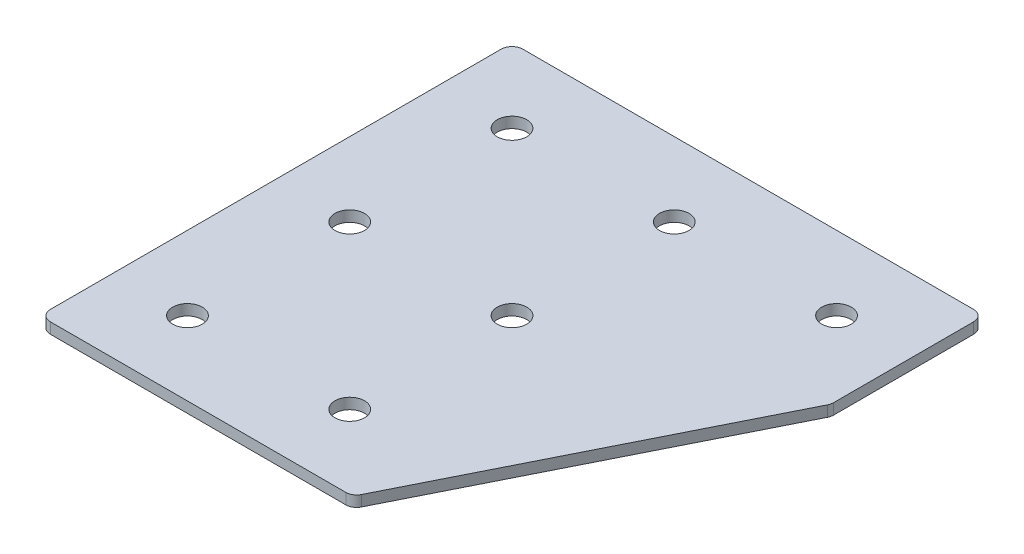
ISO-10303-21;
HEADER;
FILE_DESCRIPTION(('STEP AP214'),'2;1');
FILE_NAME('part.step','',(''),(''),'','','');
FILE_SCHEMA(('AUTOMOTIVE_DESIGN { 1 0 10303 214 1 1 1 1 }'));
ENDSEC;
DATA;
#1=APPLICATION_CONTEXT('core data for automotive mechanical design processes');
#2=APPLICATION_PROTOCOL_DEFINITION('international standard','automotive_design',2000,#1);
#3=PRODUCT_CONTEXT('',#1,'mechanical');
#4=PRODUCT('Part','Part','',(#3));
#5=PRODUCT_RELATED_PRODUCT_CATEGORY('part','',(#4));
#6=PRODUCT_DEFINITION_FORMATION('','',#4);
#7=PRODUCT_DEFINITION_CONTEXT('part definition',#1,'design');
#8=PRODUCT_DEFINITION('design','',#6,#7);
#9=PRODUCT_DEFINITION_SHAPE('','',#8);
#10=(LENGTH_UNIT() NAMED_UNIT(*) SI_UNIT(.MILLI.,.METRE.));
#11=(NAMED_UNIT(*) PLANE_ANGLE_UNIT() SI_UNIT($,.RADIAN.));
#12=(NAMED_UNIT(*) SI_UNIT($,.STERADIAN.) SOLID_ANGLE_UNIT());
#13=UNCERTAINTY_MEASURE_WITH_UNIT(LENGTH_MEASURE(1.E-05),#10,'distance_accuracy_value','');
#14=(GEOMETRIC_REPRESENTATION_CONTEXT(3) GLOBAL_UNCERTAINTY_ASSIGNED_CONTEXT((#13)) GLOBAL_UNIT_ASSIGNED_CONTEXT((#10,
#11,#12)) REPRESENTATION_CONTEXT('',''));
#15=CARTESIAN_POINT('',(0.,0.,0.));
#16=DIRECTION('',(0.,0.,1.));
#17=DIRECTION('',(1.,0.,0.));
#18=AXIS2_PLACEMENT_3D('',#15,#16,#17);
#19=CARTESIAN_POINT('',(-24.6826268608719,2.29118221115959,-46.6079392270853));
#20=DIRECTION('',(0.,-1.,0.));
#21=DIRECTION('',(0.,0.,-1.));
#22=AXIS2_PLACEMENT_3D('',#19,#20,#21);
#23=PLANE('',#22);
#24=CARTESIAN_POINT('',(-2.18262686087191,2.29118221115959,43.3920607729147));
#25=DIRECTION('',(0.,1.,0.));
#26=DIRECTION('',(0.,0.,1.));
#27=AXIS2_PLACEMENT_3D('',#24,#25,#26);
#28=CIRCLE('',#27,4.1);
#29=CARTESIAN_POINT('',(-2.18262686087191,2.29118221115959,47.4920607729147));
#30=VERTEX_POINT('',#29);
#31=EDGE_CURVE('E255',#30,#30,#28,.T.);
#32=ORIENTED_EDGE('',*,*,#31,.T.);
#33=EDGE_LOOP('',(#32));
#34=FACE_BOUND('',#33,.T.);
#35=CARTESIAN_POINT('',(-47.1826268608719,2.29118221115959,43.3920607729147));
#36=DIRECTION('',(0.,1.,0.));
#37=DIRECTION('',(0.,0.,1.));
#38=AXIS2_PLACEMENT_3D('',#35,#36,#37);
#39=CIRCLE('',#38,4.1);
#40=CARTESIAN_POINT('',(-47.1826268608719,2.29118221115959,47.4920607729147));
#41=VERTEX_POINT('',#40);
#42=EDGE_CURVE('E263',#41,#41,#39,.T.);
#43=ORIENTED_EDGE('',*,*,#42,.T.);
#44=EDGE_LOOP('',(#43));
#45=FACE_BOUND('',#44,.T.);
#46=CARTESIAN_POINT('',(-2.18262686087191,2.29118221115959,-1.60793922708531));
#47=DIRECTION('',(0.,1.,0.));
#48=DIRECTION('',(0.,0.,1.));
#49=AXIS2_PLACEMENT_3D('',#46,#47,#48);
#50=CIRCLE('',#49,4.1);
#51=CARTESIAN_POINT('',(-2.18262686087191,2.29118221115959,2.49206077291469));
#52=VERTEX_POINT('',#51);
#53=EDGE_CURVE('E269',#52,#52,#50,.T.);
#54=ORIENTED_EDGE('',*,*,#53,.T.);
#55=EDGE_LOOP('',(#54));
#56=FACE_BOUND('',#55,.T.);
#57=CARTESIAN_POINT('',(-47.1826268608719,2.29118221115959,-1.60793922708531));
#58=DIRECTION('',(0.,1.,0.));
#59=DIRECTION('',(0.,0.,1.));
#60=AXIS2_PLACEMENT_3D('',#57,#58,#59);
#61=CIRCLE('',#60,4.1);
#62=CARTESIAN_POINT('',(-47.1826268608719,2.29118221115959,2.49206077291469));
#63=VERTEX_POINT('',#62);
#64=EDGE_CURVE('E275',#63,#63,#61,.T.);
#65=ORIENTED_EDGE('',*,*,#64,.T.);
#66=EDGE_LOOP('',(#65));
#67=FACE_BOUND('',#66,.T.);
#68=CARTESIAN_POINT('',(42.8173731391281,2.29118221115959,-46.6079392270853));
#69=DIRECTION('',(0.,1.,0.));
#70=DIRECTION('',(0.,0.,1.));
#71=AXIS2_PLACEMENT_3D('',#68,#69,#70);
#72=CIRCLE('',#71,4.09999999999999);
#73=CARTESIAN_POINT('',(42.8173731391281,2.29118221115959,-42.5079392270853));
#74=VERTEX_POINT('',#73);
#75=EDGE_CURVE('E281',#74,#74,#72,.T.);
#76=ORIENTED_EDGE('',*,*,#75,.T.);
#77=EDGE_LOOP('',(#76));
#78=FACE_BOUND('',#77,.T.);
#79=CARTESIAN_POINT('',(-2.1826268608719,2.29118221115959,-46.6079392270853));
#80=DIRECTION('',(0.,1.,0.));
#81=DIRECTION('',(0.,0.,1.));
#82=AXIS2_PLACEMENT_3D('',#79,#80,#81);
#83=CIRCLE('',#82,4.1);
#84=CARTESIAN_POINT('',(-2.1826268608719,2.29118221115959,-42.5079392270853));
#85=VERTEX_POINT('',#84);
#86=EDGE_CURVE('E287',#85,#85,#83,.T.);
#87=ORIENTED_EDGE('',*,*,#86,.T.);
#88=EDGE_LOOP('',(#87));
#89=FACE_BOUND('',#88,.T.);
#90=CARTESIAN_POINT('',(-47.1826268608719,2.29118221115959,-46.6079392270853));
#91=DIRECTION('',(0.,1.,0.));
#92=DIRECTION('',(0.,0.,1.));
#93=AXIS2_PLACEMENT_3D('',#90,#91,#92);
#94=CIRCLE('',#93,4.1);
#95=CARTESIAN_POINT('',(-47.1826268608719,2.29118221115959,-42.5079392270853));
#96=VERTEX_POINT('',#95);
#97=EDGE_CURVE('E175',#96,#96,#94,.T.);
#98=ORIENTED_EDGE('',*,*,#97,.T.);
#99=EDGE_LOOP('',(#98));
#100=FACE_BOUND('',#99,.T.);
#101=DIRECTION('',(1.,0.,0.));
#102=VECTOR('',#101,1.);
#103=CARTESIAN_POINT('',(-67.682626860872,2.29118221115959,63.8920607729147));
#104=LINE('',#103,#102);
#105=CARTESIAN_POINT('',(-64.682626860872,2.29118221115959,63.8920607729147));
#106=VERTEX_POINT('',#105);
#107=CARTESIAN_POINT('',(17.2272031953787,2.29118221115959,63.8920607729147));
#108=VERTEX_POINT('',#107);
#109=EDGE_CURVE('E121',#106,#108,#104,.T.);
#110=ORIENTED_EDGE('',*,*,#109,.F.);
#111=CARTESIAN_POINT('',(-64.682626860872,2.29118221115959,60.8920607729147));
#112=DIRECTION('',(0.,-1.,0.));
#113=DIRECTION('',(0.,0.,-1.));
#114=AXIS2_PLACEMENT_3D('',#111,#112,#113);
#115=CIRCLE('',#114,3.);
#116=CARTESIAN_POINT('',(-67.682626860872,2.29118221115959,60.8920607729147));
#117=VERTEX_POINT('',#116);
#118=EDGE_CURVE('E145',#106,#117,#115,.T.);
#119=ORIENTED_EDGE('',*,*,#118,.T.);
#120=DIRECTION('',(0.,0.,1.));
#121=VECTOR('',#120,1.);
#122=CARTESIAN_POINT('',(-67.682626860872,2.29118221115959,-67.1079392270853));
#123=LINE('',#122,#121);
#124=CARTESIAN_POINT('',(-67.682626860872,2.29118221115959,-64.1079392270853));
#125=VERTEX_POINT('',#124);
#126=EDGE_CURVE('E162',#125,#117,#123,.T.);
#127=ORIENTED_EDGE('',*,*,#126,.F.);
#128=CARTESIAN_POINT('',(-64.682626860872,2.29118221115959,-64.1079392270853));
#129=DIRECTION('',(0.,-1.,0.));
#130=DIRECTION('',(0.,0.,-1.));
#131=AXIS2_PLACEMENT_3D('',#128,#129,#130);
#132=CIRCLE('',#131,3.);
#133=CARTESIAN_POINT('',(-64.682626860872,2.29118221115959,-67.1079392270853));
#134=VERTEX_POINT('',#133);
#135=EDGE_CURVE('E117',#125,#134,#132,.T.);
#136=ORIENTED_EDGE('',*,*,#135,.T.);
#137=DIRECTION('',(-1.,0.,0.));
#138=VECTOR('',#137,1.);
#139=CARTESIAN_POINT('',(63.317373139128,2.29118221115959,-67.1079392270854));
#140=LINE('',#139,#138);
#141=CARTESIAN_POINT('',(60.317373139128,2.29118221115959,-67.1079392270854));
#142=VERTEX_POINT('',#141);
#143=EDGE_CURVE('E160',#142,#134,#140,.T.);
#144=ORIENTED_EDGE('',*,*,#143,.F.);
#145=CARTESIAN_POINT('',(60.317373139128,2.29118221115959,-64.1079392270854));
#146=DIRECTION('',(0.,-1.,0.));
#147=DIRECTION('',(0.,0.,-1.));
#148=AXIS2_PLACEMENT_3D('',#145,#146,#147);
#149=CIRCLE('',#148,3.);
#150=CARTESIAN_POINT('',(63.317373139128,2.29118221115959,-64.1079392270854));
#151=VERTEX_POINT('',#150);
#152=EDGE_CURVE('E140',#142,#151,#149,.T.);
#153=ORIENTED_EDGE('',*,*,#152,.T.);
#154=DIRECTION('',(0.,0.,-1.));
#155=VECTOR('',#154,1.);
#156=CARTESIAN_POINT('',(63.317373139128,2.29118221115959,-24.5800751820849));
#157=LINE('',#156,#155);
#158=CARTESIAN_POINT('',(63.317373139128,2.29118221115959,-25.2882791145842));
#159=VERTEX_POINT('',#158);
#160=EDGE_CURVE('E163',#159,#151,#157,.T.);
#161=ORIENTED_EDGE('',*,*,#160,.F.);
#162=CARTESIAN_POINT('',(60.317373139128,2.29118221115959,-25.2882791145842));
#163=DIRECTION('',(0.,-1.,0.));
#164=DIRECTION('',(0.,0.,-1.));
#165=AXIS2_PLACEMENT_3D('',#162,#163,#164);
#166=CIRCLE('',#165,3.);
#167=CARTESIAN_POINT('',(63.0006547121278,2.29118221115959,-23.9466383280844));
#168=VERTEX_POINT('',#167);
#169=EDGE_CURVE('E31',#159,#168,#166,.T.);
#170=ORIENTED_EDGE('',*,*,#169,.T.);
#171=DIRECTION('',(0.447213595499957,0.,-0.894427190999917));
#172=VECTOR('',#171,1.);
#173=CARTESIAN_POINT('',(19.0813051616284,2.29118221115959,63.8920607729147));
#174=LINE('',#173,#172);
#175=CARTESIAN_POINT('',(19.9104847683784,2.29118221115959,62.2337015594145));
#176=VERTEX_POINT('',#175);
#177=EDGE_CURVE('E118',#176,#168,#174,.T.);
#178=ORIENTED_EDGE('',*,*,#177,.F.);
#179=CARTESIAN_POINT('',(17.2272031953787,2.29118221115959,60.8920607729147));
#180=DIRECTION('',(0.,-1.,0.));
#181=DIRECTION('',(0.,0.,-1.));
#182=AXIS2_PLACEMENT_3D('',#179,#180,#181);
#183=CIRCLE('',#182,3.);
#184=EDGE_CURVE('E143',#176,#108,#183,.T.);
#185=ORIENTED_EDGE('',*,*,#184,.T.);
#186=EDGE_LOOP('',(#110,#119,#127,#136,#144,#153,#161,#170,#178,#185));
#187=FACE_BOUND('',#186,.T.);
#188=ADVANCED_FACE('F16',(#34,#45,#56,#67,#78,#89,#100,#187),#23,.T.);
#189=CARTESIAN_POINT('',(63.317373139128,2.29118221115959,-24.5800751820849));
#190=DIRECTION('',(1.,0.,0.));
#191=DIRECTION('',(0.,0.,-1.));
#192=AXIS2_PLACEMENT_3D('',#189,#190,#191);
#193=PLANE('',#192);
#194=DIRECTION('',(0.,0.,-1.));
#195=VECTOR('',#194,1.);
#196=CARTESIAN_POINT('',(63.317373139128,5.29118221115959,-24.5800751820849));
#197=LINE('',#196,#195);
#198=CARTESIAN_POINT('',(63.317373139128,5.29118221115959,-25.2882791145842));
#199=VERTEX_POINT('',#198);
#200=CARTESIAN_POINT('',(63.317373139128,5.29118221115959,-64.1079392270854));
#201=VERTEX_POINT('',#200);
#202=EDGE_CURVE('E172',#199,#201,#197,.T.);
#203=ORIENTED_EDGE('',*,*,#202,.F.);
#204=DIRECTION('',(0.,1.,0.));
#205=VECTOR('',#204,1.);
#206=CARTESIAN_POINT('',(63.317373139128,2.29118221115959,-25.2882791145842));
#207=LINE('',#206,#205);
#208=EDGE_CURVE('E154',#199,#159,#207,.F.);
#209=ORIENTED_EDGE('',*,*,#208,.T.);
#210=ORIENTED_EDGE('',*,*,#160,.T.);
#211=DIRECTION('',(0.,1.,0.));
#212=VECTOR('',#211,1.);
#213=CARTESIAN_POINT('',(63.317373139128,2.29118221115959,-64.1079392270854));
#214=LINE('',#213,#212);
#215=EDGE_CURVE('E151',#151,#201,#214,.T.);
#216=ORIENTED_EDGE('',*,*,#215,.T.);
#217=EDGE_LOOP('',(#203,#209,#210,#216));
#218=FACE_BOUND('',#217,.T.);
#219=ADVANCED_FACE('F206',(#218),#193,.T.);
#220=CARTESIAN_POINT('',(19.0813051616284,2.29118221115959,63.8920607729147));
#221=DIRECTION('',(0.894427190999917,0.,0.447213595499957));
#222=DIRECTION('',(0.447213595499957,0.,-0.894427190999917));
#223=AXIS2_PLACEMENT_3D('',#220,#221,#222);
#224=PLANE('',#223);
#225=DIRECTION('',(0.447213595499957,0.,-0.894427190999917));
#226=VECTOR('',#225,1.);
#227=CARTESIAN_POINT('',(19.0813051616284,5.29118221115959,63.8920607729147));
#228=LINE('',#227,#226);
#229=CARTESIAN_POINT('',(19.9104847683784,5.29118221115959,62.2337015594145));
#230=VERTEX_POINT('',#229);
#231=CARTESIAN_POINT('',(63.0006547121278,5.29118221115959,-23.9466383280844));
#232=VERTEX_POINT('',#231);
#233=EDGE_CURVE('E124',#230,#232,#228,.T.);
#234=ORIENTED_EDGE('',*,*,#233,.F.);
#235=DIRECTION('',(0.,1.,0.));
#236=VECTOR('',#235,1.);
#237=CARTESIAN_POINT('',(19.9104847683784,2.29118221115959,62.2337015594145));
#238=LINE('',#237,#236);
#239=EDGE_CURVE('E38',#230,#176,#238,.F.);
#240=ORIENTED_EDGE('',*,*,#239,.T.);
#241=ORIENTED_EDGE('',*,*,#177,.T.);
#242=DIRECTION('',(0.,1.,0.));
#243=VECTOR('',#242,1.);
#244=CARTESIAN_POINT('',(63.0006547121277,2.29118221115959,-23.9466383280844));
#245=LINE('',#244,#243);
#246=EDGE_CURVE('E147',#168,#232,#245,.T.);
#247=ORIENTED_EDGE('',*,*,#246,.T.);
#248=EDGE_LOOP('',(#234,#240,#241,#247));
#249=FACE_BOUND('',#248,.T.);
#250=ADVANCED_FACE('F180',(#249),#224,.T.);
#251=CARTESIAN_POINT('',(-67.682626860872,2.29118221115959,63.8920607729147));
#252=DIRECTION('',(0.,0.,1.));
#253=DIRECTION('',(1.,0.,0.));
#254=AXIS2_PLACEMENT_3D('',#251,#252,#253);
#255=PLANE('',#254);
#256=DIRECTION('',(1.,0.,0.));
#257=VECTOR('',#256,1.);
#258=CARTESIAN_POINT('',(-67.682626860872,5.29118221115959,63.8920607729147));
#259=LINE('',#258,#257);
#260=CARTESIAN_POINT('',(-64.682626860872,5.29118221115959,63.8920607729147));
#261=VERTEX_POINT('',#260);
#262=CARTESIAN_POINT('',(17.2272031953787,5.29118221115959,63.8920607729147));
#263=VERTEX_POINT('',#262);
#264=EDGE_CURVE('E114',#261,#263,#259,.T.);
#265=ORIENTED_EDGE('',*,*,#264,.F.);
#266=DIRECTION('',(0.,1.,0.));
#267=VECTOR('',#266,1.);
#268=CARTESIAN_POINT('',(-64.682626860872,2.29118221115959,63.8920607729147));
#269=LINE('',#268,#267);
#270=EDGE_CURVE('E137',#261,#106,#269,.F.);
#271=ORIENTED_EDGE('',*,*,#270,.T.);
#272=ORIENTED_EDGE('',*,*,#109,.T.);
#273=DIRECTION('',(0.,1.,0.));
#274=VECTOR('',#273,1.);
#275=CARTESIAN_POINT('',(17.2272031953787,2.29118221115959,63.8920607729147));
#276=LINE('',#275,#274);
#277=EDGE_CURVE('E134',#108,#263,#276,.T.);
#278=ORIENTED_EDGE('',*,*,#277,.T.);
#279=EDGE_LOOP('',(#265,#271,#272,#278));
#280=FACE_BOUND('',#279,.T.);
#281=ADVANCED_FACE('F189',(#280),#255,.T.);
#282=CARTESIAN_POINT('',(-67.682626860872,2.29118221115959,-67.1079392270853));
#283=DIRECTION('',(-1.,0.,0.));
#284=DIRECTION('',(0.,0.,1.));
#285=AXIS2_PLACEMENT_3D('',#282,#283,#284);
#286=PLANE('',#285);
#287=ORIENTED_EDGE('',*,*,#126,.T.);
#288=DIRECTION('',(0.,1.,0.));
#289=VECTOR('',#288,1.);
#290=CARTESIAN_POINT('',(-67.682626860872,2.29118221115959,60.8920607729147));
#291=LINE('',#290,#289);
#292=CARTESIAN_POINT('',(-67.682626860872,5.29118221115959,60.8920607729147));
#293=VERTEX_POINT('',#292);
#294=EDGE_CURVE('E105',#117,#293,#291,.T.);
#295=ORIENTED_EDGE('',*,*,#294,.T.);
#296=DIRECTION('',(0.,0.,1.));
#297=VECTOR('',#296,1.);
#298=CARTESIAN_POINT('',(-67.682626860872,5.29118221115959,-67.1079392270853));
#299=LINE('',#298,#297);
#300=CARTESIAN_POINT('',(-67.682626860872,5.29118221115959,-64.1079392270853));
#301=VERTEX_POINT('',#300);
#302=EDGE_CURVE('E97',#301,#293,#299,.T.);
#303=ORIENTED_EDGE('',*,*,#302,.F.);
#304=DIRECTION('',(0.,1.,0.));
#305=VECTOR('',#304,1.);
#306=CARTESIAN_POINT('',(-67.682626860872,2.29118221115959,-64.1079392270853));
#307=LINE('',#306,#305);
#308=EDGE_CURVE('E111',#301,#125,#307,.F.);
#309=ORIENTED_EDGE('',*,*,#308,.T.);
#310=EDGE_LOOP('',(#287,#295,#303,#309));
#311=FACE_BOUND('',#310,.T.);
#312=ADVANCED_FACE('F110',(#311),#286,.T.);
#313=CARTESIAN_POINT('',(63.317373139128,2.29118221115959,-67.1079392270854));
#314=DIRECTION('',(0.,0.,-1.));
#315=DIRECTION('',(-1.,0.,0.));
#316=AXIS2_PLACEMENT_3D('',#313,#314,#315);
#317=PLANE('',#316);
#318=DIRECTION('',(-1.,0.,0.));
#319=VECTOR('',#318,1.);
#320=CARTESIAN_POINT('',(63.317373139128,5.29118221115959,-67.1079392270854));
#321=LINE('',#320,#319);
#322=CARTESIAN_POINT('',(60.317373139128,5.29118221115959,-67.1079392270854));
#323=VERTEX_POINT('',#322);
#324=CARTESIAN_POINT('',(-64.682626860872,5.29118221115959,-67.1079392270853));
#325=VERTEX_POINT('',#324);
#326=EDGE_CURVE('E99',#323,#325,#321,.T.);
#327=ORIENTED_EDGE('',*,*,#326,.F.);
#328=DIRECTION('',(0.,1.,0.));
#329=VECTOR('',#328,1.);
#330=CARTESIAN_POINT('',(60.317373139128,2.29118221115959,-67.1079392270854));
#331=LINE('',#330,#329);
#332=EDGE_CURVE('E10',#323,#142,#331,.F.);
#333=ORIENTED_EDGE('',*,*,#332,.T.);
#334=ORIENTED_EDGE('',*,*,#143,.T.);
#335=DIRECTION('',(0.,1.,0.));
#336=VECTOR('',#335,1.);
#337=CARTESIAN_POINT('',(-64.682626860872,2.29118221115959,-67.1079392270853));
#338=LINE('',#337,#336);
#339=EDGE_CURVE('E24',#134,#325,#338,.T.);
#340=ORIENTED_EDGE('',*,*,#339,.T.);
#341=EDGE_LOOP('',(#327,#333,#334,#340));
#342=FACE_BOUND('',#341,.T.);
#343=ADVANCED_FACE('F157',(#342),#317,.T.);
#344=CARTESIAN_POINT('',(-24.6826268608719,5.29118221115959,-46.6079392270853));
#345=DIRECTION('',(0.,-1.,0.));
#346=DIRECTION('',(0.,0.,-1.));
#347=AXIS2_PLACEMENT_3D('',#344,#345,#346);
#348=PLANE('',#347);
#349=CARTESIAN_POINT('',(-2.18262686087191,5.29118221115959,43.3920607729147));
#350=DIRECTION('',(0.,1.,0.));
#351=DIRECTION('',(0.,0.,1.));
#352=AXIS2_PLACEMENT_3D('',#349,#350,#351);
#353=CIRCLE('',#352,4.1);
#354=CARTESIAN_POINT('',(-2.18262686087191,5.29118221115959,47.4920607729147));
#355=VERTEX_POINT('',#354);
#356=EDGE_CURVE('E258',#355,#355,#353,.T.);
#357=ORIENTED_EDGE('',*,*,#356,.F.);
#358=EDGE_LOOP('',(#357));
#359=FACE_BOUND('',#358,.T.);
#360=CARTESIAN_POINT('',(-47.1826268608719,5.29118221115959,43.3920607729147));
#361=DIRECTION('',(0.,1.,0.));
#362=DIRECTION('',(0.,0.,1.));
#363=AXIS2_PLACEMENT_3D('',#360,#361,#362);
#364=CIRCLE('',#363,4.1);
#365=CARTESIAN_POINT('',(-47.1826268608719,5.29118221115959,47.4920607729147));
#366=VERTEX_POINT('',#365);
#367=EDGE_CURVE('E260',#366,#366,#364,.T.);
#368=ORIENTED_EDGE('',*,*,#367,.F.);
#369=EDGE_LOOP('',(#368));
#370=FACE_BOUND('',#369,.T.);
#371=CARTESIAN_POINT('',(-2.18262686087191,5.29118221115959,-1.60793922708531));
#372=DIRECTION('',(0.,1.,0.));
#373=DIRECTION('',(0.,0.,1.));
#374=AXIS2_PLACEMENT_3D('',#371,#372,#373);
#375=CIRCLE('',#374,4.1);
#376=CARTESIAN_POINT('',(-2.18262686087191,5.29118221115959,2.49206077291469));
#377=VERTEX_POINT('',#376);
#378=EDGE_CURVE('E266',#377,#377,#375,.T.);
#379=ORIENTED_EDGE('',*,*,#378,.F.);
#380=EDGE_LOOP('',(#379));
#381=FACE_BOUND('',#380,.T.);
#382=CARTESIAN_POINT('',(-47.1826268608719,5.29118221115959,-1.60793922708531));
#383=DIRECTION('',(0.,1.,0.));
#384=DIRECTION('',(0.,0.,1.));
#385=AXIS2_PLACEMENT_3D('',#382,#383,#384);
#386=CIRCLE('',#385,4.1);
#387=CARTESIAN_POINT('',(-47.1826268608719,5.29118221115959,2.49206077291469));
#388=VERTEX_POINT('',#387);
#389=EDGE_CURVE('E272',#388,#388,#386,.T.);
#390=ORIENTED_EDGE('',*,*,#389,.F.);
#391=EDGE_LOOP('',(#390));
#392=FACE_BOUND('',#391,.T.);
#393=CARTESIAN_POINT('',(42.8173731391281,5.29118221115959,-46.6079392270853));
#394=DIRECTION('',(0.,1.,0.));
#395=DIRECTION('',(0.,0.,1.));
#396=AXIS2_PLACEMENT_3D('',#393,#394,#395);
#397=CIRCLE('',#396,4.09999999999999);
#398=CARTESIAN_POINT('',(42.8173731391281,5.29118221115959,-42.5079392270853));
#399=VERTEX_POINT('',#398);
#400=EDGE_CURVE('E278',#399,#399,#397,.T.);
#401=ORIENTED_EDGE('',*,*,#400,.F.);
#402=EDGE_LOOP('',(#401));
#403=FACE_BOUND('',#402,.T.);
#404=CARTESIAN_POINT('',(-2.1826268608719,5.29118221115959,-46.6079392270853));
#405=DIRECTION('',(0.,1.,0.));
#406=DIRECTION('',(0.,0.,1.));
#407=AXIS2_PLACEMENT_3D('',#404,#405,#406);
#408=CIRCLE('',#407,4.1);
#409=CARTESIAN_POINT('',(-2.1826268608719,5.29118221115959,-42.5079392270853));
#410=VERTEX_POINT('',#409);
#411=EDGE_CURVE('E284',#410,#410,#408,.T.);
#412=ORIENTED_EDGE('',*,*,#411,.F.);
#413=EDGE_LOOP('',(#412));
#414=FACE_BOUND('',#413,.T.);
#415=CARTESIAN_POINT('',(-47.1826268608719,5.29118221115959,-46.6079392270853));
#416=DIRECTION('',(0.,1.,0.));
#417=DIRECTION('',(0.,0.,1.));
#418=AXIS2_PLACEMENT_3D('',#415,#416,#417);
#419=CIRCLE('',#418,4.1);
#420=CARTESIAN_POINT('',(-47.1826268608719,5.29118221115959,-42.5079392270853));
#421=VERTEX_POINT('',#420);
#422=EDGE_CURVE('E290',#421,#421,#419,.T.);
#423=ORIENTED_EDGE('',*,*,#422,.F.);
#424=EDGE_LOOP('',(#423));
#425=FACE_BOUND('',#424,.T.);
#426=ORIENTED_EDGE('',*,*,#302,.T.);
#427=CARTESIAN_POINT('',(-64.682626860872,5.29118221115959,60.8920607729147));
#428=DIRECTION('',(0.,-1.,0.));
#429=DIRECTION('',(0.,0.,-1.));
#430=AXIS2_PLACEMENT_3D('',#427,#428,#429);
#431=CIRCLE('',#430,3.);
#432=EDGE_CURVE('E132',#293,#261,#431,.F.);
#433=ORIENTED_EDGE('',*,*,#432,.T.);
#434=ORIENTED_EDGE('',*,*,#264,.T.);
#435=CARTESIAN_POINT('',(17.2272031953787,5.29118221115959,60.8920607729147));
#436=DIRECTION('',(0.,-1.,0.));
#437=DIRECTION('',(0.,0.,-1.));
#438=AXIS2_PLACEMENT_3D('',#435,#436,#437);
#439=CIRCLE('',#438,3.);
#440=EDGE_CURVE('E130',#263,#230,#439,.F.);
#441=ORIENTED_EDGE('',*,*,#440,.T.);
#442=ORIENTED_EDGE('',*,*,#233,.T.);
#443=CARTESIAN_POINT('',(60.317373139128,5.29118221115959,-25.2882791145842));
#444=DIRECTION('',(0.,-1.,0.));
#445=DIRECTION('',(0.,0.,-1.));
#446=AXIS2_PLACEMENT_3D('',#443,#444,#445);
#447=CIRCLE('',#446,3.);
#448=EDGE_CURVE('E128',#232,#199,#447,.F.);
#449=ORIENTED_EDGE('',*,*,#448,.T.);
#450=ORIENTED_EDGE('',*,*,#202,.T.);
#451=CARTESIAN_POINT('',(60.317373139128,5.29118221115959,-64.1079392270854));
#452=DIRECTION('',(0.,-1.,0.));
#453=DIRECTION('',(0.,0.,-1.));
#454=AXIS2_PLACEMENT_3D('',#451,#452,#453);
#455=CIRCLE('',#454,3.);
#456=EDGE_CURVE('E104',#201,#323,#455,.F.);
#457=ORIENTED_EDGE('',*,*,#456,.T.);
#458=ORIENTED_EDGE('',*,*,#326,.T.);
#459=CARTESIAN_POINT('',(-64.682626860872,5.29118221115959,-64.1079392270853));
#460=DIRECTION('',(0.,-1.,0.));
#461=DIRECTION('',(0.,0.,-1.));
#462=AXIS2_PLACEMENT_3D('',#459,#460,#461);
#463=CIRCLE('',#462,3.);
#464=EDGE_CURVE('E94',#325,#301,#463,.F.);
#465=ORIENTED_EDGE('',*,*,#464,.T.);
#466=EDGE_LOOP('',(#426,#433,#434,#441,#442,#449,#450,#457,#458,#465));
#467=FACE_BOUND('',#466,.T.);
#468=ADVANCED_FACE('F96',(#359,#370,#381,#392,#403,#414,#425,#467),#348,.F.);
#469=CARTESIAN_POINT('',(-64.682626860872,2.29118221115959,60.8920607729147));
#470=DIRECTION('',(0.,1.,0.));
#471=DIRECTION('',(0.,0.,1.));
#472=AXIS2_PLACEMENT_3D('',#469,#470,#471);
#473=CYLINDRICAL_SURFACE('',#472,3.);
#474=ORIENTED_EDGE('',*,*,#118,.F.);
#475=ORIENTED_EDGE('',*,*,#270,.F.);
#476=ORIENTED_EDGE('',*,*,#432,.F.);
#477=ORIENTED_EDGE('',*,*,#294,.F.);
#478=EDGE_LOOP('',(#474,#475,#476,#477));
#479=FACE_BOUND('',#478,.T.);
#480=ADVANCED_FACE('F192',(#479),#473,.T.);
#481=CARTESIAN_POINT('',(17.2272031953787,2.29118221115959,60.8920607729147));
#482=DIRECTION('',(0.,1.,0.));
#483=DIRECTION('',(0.,0.,1.));
#484=AXIS2_PLACEMENT_3D('',#481,#482,#483);
#485=CYLINDRICAL_SURFACE('',#484,3.);
#486=ORIENTED_EDGE('',*,*,#184,.F.);
#487=ORIENTED_EDGE('',*,*,#239,.F.);
#488=ORIENTED_EDGE('',*,*,#440,.F.);
#489=ORIENTED_EDGE('',*,*,#277,.F.);
#490=EDGE_LOOP('',(#486,#487,#488,#489));
#491=FACE_BOUND('',#490,.T.);
#492=ADVANCED_FACE('F184',(#491),#485,.T.);
#493=CARTESIAN_POINT('',(60.317373139128,2.29118221115959,-25.2882791145842));
#494=DIRECTION('',(0.,1.,0.));
#495=DIRECTION('',(0.,0.,1.));
#496=AXIS2_PLACEMENT_3D('',#493,#494,#495);
#497=CYLINDRICAL_SURFACE('',#496,3.);
#498=ORIENTED_EDGE('',*,*,#169,.F.);
#499=ORIENTED_EDGE('',*,*,#208,.F.);
#500=ORIENTED_EDGE('',*,*,#448,.F.);
#501=ORIENTED_EDGE('',*,*,#246,.F.);
#502=EDGE_LOOP('',(#498,#499,#500,#501));
#503=FACE_BOUND('',#502,.T.);
#504=ADVANCED_FACE('F200',(#503),#497,.T.);
#505=CARTESIAN_POINT('',(60.317373139128,2.29118221115959,-64.1079392270854));
#506=DIRECTION('',(0.,1.,0.));
#507=DIRECTION('',(0.,0.,1.));
#508=AXIS2_PLACEMENT_3D('',#505,#506,#507);
#509=CYLINDRICAL_SURFACE('',#508,3.);
#510=ORIENTED_EDGE('',*,*,#152,.F.);
#511=ORIENTED_EDGE('',*,*,#332,.F.);
#512=ORIENTED_EDGE('',*,*,#456,.F.);
#513=ORIENTED_EDGE('',*,*,#215,.F.);
#514=EDGE_LOOP('',(#510,#511,#512,#513));
#515=FACE_BOUND('',#514,.T.);
#516=ADVANCED_FACE('F356',(#515),#509,.T.);
#517=CARTESIAN_POINT('',(-64.682626860872,2.29118221115959,-64.1079392270853));
#518=DIRECTION('',(0.,1.,0.));
#519=DIRECTION('',(0.,0.,1.));
#520=AXIS2_PLACEMENT_3D('',#517,#518,#519);
#521=CYLINDRICAL_SURFACE('',#520,3.);
#522=ORIENTED_EDGE('',*,*,#135,.F.);
#523=ORIENTED_EDGE('',*,*,#308,.F.);
#524=ORIENTED_EDGE('',*,*,#464,.F.);
#525=ORIENTED_EDGE('',*,*,#339,.F.);
#526=EDGE_LOOP('',(#522,#523,#524,#525));
#527=FACE_BOUND('',#526,.T.);
#528=ADVANCED_FACE('F18',(#527),#521,.T.);
#529=CARTESIAN_POINT('',(-47.1826268608719,2.29118221115959,-46.6079392270853));
#530=DIRECTION('',(0.,1.,0.));
#531=DIRECTION('',(0.,0.,1.));
#532=AXIS2_PLACEMENT_3D('',#529,#530,#531);
#533=CYLINDRICAL_SURFACE('',#532,4.1);
#534=ORIENTED_EDGE('',*,*,#97,.F.);
#535=EDGE_LOOP('',(#534));
#536=FACE_BOUND('',#535,.T.);
#537=ORIENTED_EDGE('',*,*,#422,.T.);
#538=EDGE_LOOP('',(#537));
#539=FACE_BOUND('',#538,.T.);
#540=ADVANCED_FACE('F224',(#536,#539),#533,.F.);
#541=CARTESIAN_POINT('',(-2.1826268608719,2.29118221115959,-46.6079392270853));
#542=DIRECTION('',(0.,1.,0.));
#543=DIRECTION('',(0.,0.,1.));
#544=AXIS2_PLACEMENT_3D('',#541,#542,#543);
#545=CYLINDRICAL_SURFACE('',#544,4.1);
#546=ORIENTED_EDGE('',*,*,#86,.F.);
#547=EDGE_LOOP('',(#546));
#548=FACE_BOUND('',#547,.T.);
#549=ORIENTED_EDGE('',*,*,#411,.T.);
#550=EDGE_LOOP('',(#549));
#551=FACE_BOUND('',#550,.T.);
#552=ADVANCED_FACE('F227',(#548,#551),#545,.F.);
#553=CARTESIAN_POINT('',(42.8173731391281,2.29118221115959,-46.6079392270853));
#554=DIRECTION('',(0.,1.,0.));
#555=DIRECTION('',(0.,0.,1.));
#556=AXIS2_PLACEMENT_3D('',#553,#554,#555);
#557=CYLINDRICAL_SURFACE('',#556,4.09999999999999);
#558=ORIENTED_EDGE('',*,*,#75,.F.);
#559=EDGE_LOOP('',(#558));
#560=FACE_BOUND('',#559,.T.);
#561=ORIENTED_EDGE('',*,*,#400,.T.);
#562=EDGE_LOOP('',(#561));
#563=FACE_BOUND('',#562,.T.);
#564=ADVANCED_FACE('F231',(#560,#563),#557,.F.);
#565=CARTESIAN_POINT('',(-47.1826268608719,2.29118221115959,-1.60793922708531));
#566=DIRECTION('',(0.,1.,0.));
#567=DIRECTION('',(0.,0.,1.));
#568=AXIS2_PLACEMENT_3D('',#565,#566,#567);
#569=CYLINDRICAL_SURFACE('',#568,4.1);
#570=ORIENTED_EDGE('',*,*,#64,.F.);
#571=EDGE_LOOP('',(#570));
#572=FACE_BOUND('',#571,.T.);
#573=ORIENTED_EDGE('',*,*,#389,.T.);
#574=EDGE_LOOP('',(#573));
#575=FACE_BOUND('',#574,.T.);
#576=ADVANCED_FACE('F235',(#572,#575),#569,.F.);
#577=CARTESIAN_POINT('',(-2.18262686087191,2.29118221115959,-1.60793922708531));
#578=DIRECTION('',(0.,1.,0.));
#579=DIRECTION('',(0.,0.,1.));
#580=AXIS2_PLACEMENT_3D('',#577,#578,#579);
#581=CYLINDRICAL_SURFACE('',#580,4.1);
#582=ORIENTED_EDGE('',*,*,#53,.F.);
#583=EDGE_LOOP('',(#582));
#584=FACE_BOUND('',#583,.T.);
#585=ORIENTED_EDGE('',*,*,#378,.T.);
#586=EDGE_LOOP('',(#585));
#587=FACE_BOUND('',#586,.T.);
#588=ADVANCED_FACE('F239',(#584,#587),#581,.F.);
#589=CARTESIAN_POINT('',(-47.1826268608719,2.29118221115959,43.3920607729147));
#590=DIRECTION('',(0.,1.,0.));
#591=DIRECTION('',(0.,0.,1.));
#592=AXIS2_PLACEMENT_3D('',#589,#590,#591);
#593=CYLINDRICAL_SURFACE('',#592,4.1);
#594=ORIENTED_EDGE('',*,*,#42,.F.);
#595=EDGE_LOOP('',(#594));
#596=FACE_BOUND('',#595,.T.);
#597=ORIENTED_EDGE('',*,*,#367,.T.);
#598=EDGE_LOOP('',(#597));
#599=FACE_BOUND('',#598,.T.);
#600=ADVANCED_FACE('F243',(#596,#599),#593,.F.);
#601=CARTESIAN_POINT('',(-2.18262686087191,2.29118221115959,43.3920607729147));
#602=DIRECTION('',(0.,1.,0.));
#603=DIRECTION('',(0.,0.,1.));
#604=AXIS2_PLACEMENT_3D('',#601,#602,#603);
#605=CYLINDRICAL_SURFACE('',#604,4.1);
#606=ORIENTED_EDGE('',*,*,#31,.F.);
#607=EDGE_LOOP('',(#606));
#608=FACE_BOUND('',#607,.T.);
#609=ORIENTED_EDGE('',*,*,#356,.T.);
#610=EDGE_LOOP('',(#609));
#611=FACE_BOUND('',#610,.T.);
#612=ADVANCED_FACE('F247',(#608,#611),#605,.F.);
#613=CLOSED_SHELL('',(#188,#219,#250,#281,#312,#343,#468,#480,#492,#504,#516,#528,#540,#552,
#564,#576,#588,#600,#612));
#614=MANIFOLD_SOLID_BREP('B1',#613);
#615=ADVANCED_BREP_SHAPE_REPRESENTATION('',(#18,#614),#14);
#616=SHAPE_DEFINITION_REPRESENTATION(#9,#615);
ENDSEC;
END-ISO-10303-21;
